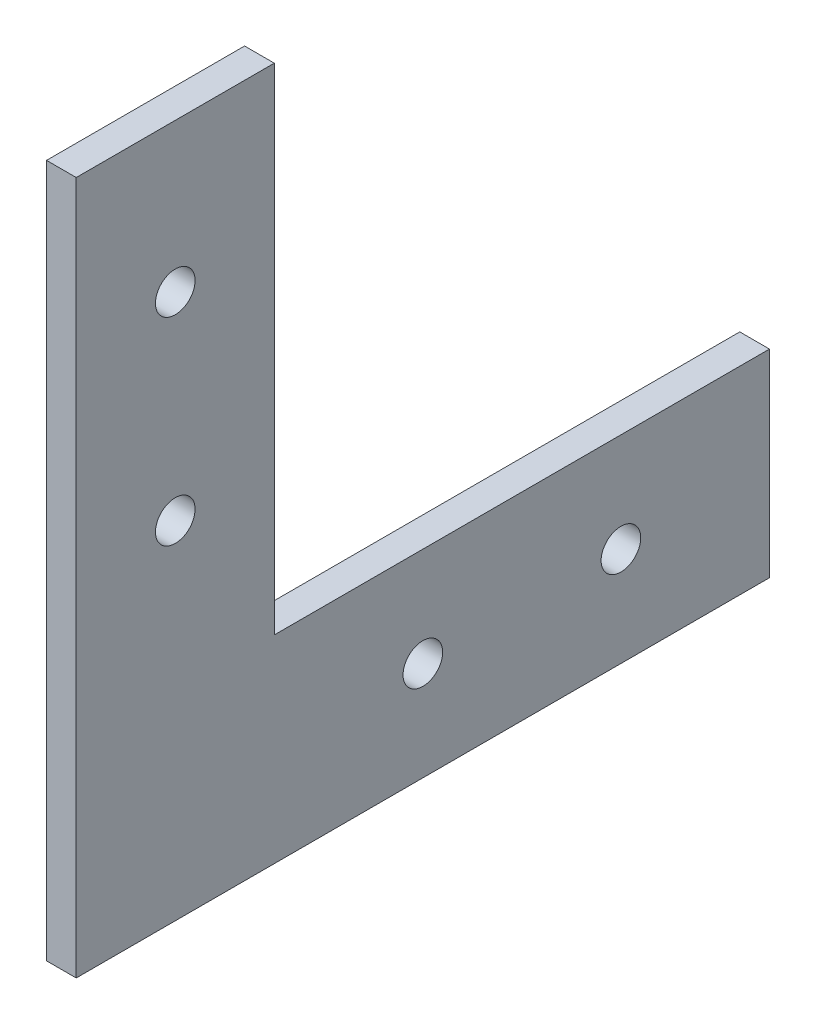
ISO-10303-21;
HEADER;
FILE_DESCRIPTION(('STEP AP214'),'2;1');
FILE_NAME('part.step','',(''),(''),'','','');
FILE_SCHEMA(('AUTOMOTIVE_DESIGN { 1 0 10303 214 1 1 1 1 }'));
ENDSEC;
DATA;
#1=APPLICATION_CONTEXT('core data for automotive mechanical design processes');
#2=APPLICATION_PROTOCOL_DEFINITION('international standard','automotive_design',2000,#1);
#3=PRODUCT_CONTEXT('',#1,'mechanical');
#4=PRODUCT('Part','Part','',(#3));
#5=PRODUCT_RELATED_PRODUCT_CATEGORY('part','',(#4));
#6=PRODUCT_DEFINITION_FORMATION('','',#4);
#7=PRODUCT_DEFINITION_CONTEXT('part definition',#1,'design');
#8=PRODUCT_DEFINITION('design','',#6,#7);
#9=PRODUCT_DEFINITION_SHAPE('','',#8);
#10=(LENGTH_UNIT() NAMED_UNIT(*) SI_UNIT(.MILLI.,.METRE.));
#11=(NAMED_UNIT(*) PLANE_ANGLE_UNIT() SI_UNIT($,.RADIAN.));
#12=(NAMED_UNIT(*) SI_UNIT($,.STERADIAN.) SOLID_ANGLE_UNIT());
#13=UNCERTAINTY_MEASURE_WITH_UNIT(LENGTH_MEASURE(1.E-05),#10,'distance_accuracy_value','');
#14=(GEOMETRIC_REPRESENTATION_CONTEXT(3) GLOBAL_UNCERTAINTY_ASSIGNED_CONTEXT((#13)) GLOBAL_UNIT_ASSIGNED_CONTEXT((#10,
#11,#12)) REPRESENTATION_CONTEXT('',''));
#15=CARTESIAN_POINT('',(0.,0.,0.));
#16=DIRECTION('',(0.,0.,1.));
#17=DIRECTION('',(1.,0.,0.));
#18=AXIS2_PLACEMENT_3D('',#15,#16,#17);
#19=CARTESIAN_POINT('',(3.,0.,0.));
#20=DIRECTION('',(0.,0.,1.));
#21=DIRECTION('',(1.,0.,0.));
#22=AXIS2_PLACEMENT_3D('',#19,#20,#21);
#23=PLANE('',#22);
#24=DIRECTION('',(0.,1.,0.));
#25=VECTOR('',#24,1.);
#26=CARTESIAN_POINT('',(0.,0.,0.));
#27=LINE('',#26,#25);
#28=CARTESIAN_POINT('',(0.,0.,0.));
#29=VERTEX_POINT('',#28);
#30=CARTESIAN_POINT('',(0.,70.,0.));
#31=VERTEX_POINT('',#30);
#32=EDGE_CURVE('E131',#29,#31,#27,.T.);
#33=ORIENTED_EDGE('',*,*,#32,.F.);
#34=DIRECTION('',(-1.,0.,0.));
#35=VECTOR('',#34,1.);
#36=CARTESIAN_POINT('',(3.,0.,0.));
#37=LINE('',#36,#35);
#38=CARTESIAN_POINT('',(3.,0.,0.));
#39=VERTEX_POINT('',#38);
#40=EDGE_CURVE('E11',#39,#29,#37,.T.);
#41=ORIENTED_EDGE('',*,*,#40,.F.);
#42=DIRECTION('',(0.,1.,0.));
#43=VECTOR('',#42,1.);
#44=CARTESIAN_POINT('',(3.,0.,0.));
#45=LINE('',#44,#43);
#46=CARTESIAN_POINT('',(3.,70.,0.));
#47=VERTEX_POINT('',#46);
#48=EDGE_CURVE('E305',#39,#47,#45,.T.);
#49=ORIENTED_EDGE('',*,*,#48,.T.);
#50=DIRECTION('',(-1.,0.,0.));
#51=VECTOR('',#50,1.);
#52=CARTESIAN_POINT('',(3.,70.,0.));
#53=LINE('',#52,#51);
#54=EDGE_CURVE('E51',#47,#31,#53,.T.);
#55=ORIENTED_EDGE('',*,*,#54,.T.);
#56=EDGE_LOOP('',(#33,#41,#49,#55));
#57=FACE_BOUND('',#56,.T.);
#58=ADVANCED_FACE('F34',(#57),#23,.T.);
#59=CARTESIAN_POINT('',(3.,0.,0.));
#60=DIRECTION('',(0.,1.,0.));
#61=DIRECTION('',(0.,0.,1.));
#62=AXIS2_PLACEMENT_3D('',#59,#60,#61);
#63=PLANE('',#62);
#64=DIRECTION('',(0.,0.,-1.));
#65=VECTOR('',#64,1.);
#66=CARTESIAN_POINT('',(0.,0.,0.));
#67=LINE('',#66,#65);
#68=CARTESIAN_POINT('',(0.,0.,-70.));
#69=VERTEX_POINT('',#68);
#70=EDGE_CURVE('E133',#29,#69,#67,.T.);
#71=ORIENTED_EDGE('',*,*,#70,.T.);
#72=DIRECTION('',(-1.,0.,0.));
#73=VECTOR('',#72,1.);
#74=CARTESIAN_POINT('',(3.,0.,-70.));
#75=LINE('',#74,#73);
#76=CARTESIAN_POINT('',(3.,0.,-70.));
#77=VERTEX_POINT('',#76);
#78=EDGE_CURVE('E43',#77,#69,#75,.T.);
#79=ORIENTED_EDGE('',*,*,#78,.F.);
#80=DIRECTION('',(0.,0.,-1.));
#81=VECTOR('',#80,1.);
#82=CARTESIAN_POINT('',(3.,0.,0.));
#83=LINE('',#82,#81);
#84=EDGE_CURVE('E114',#39,#77,#83,.T.);
#85=ORIENTED_EDGE('',*,*,#84,.F.);
#86=ORIENTED_EDGE('',*,*,#40,.T.);
#87=EDGE_LOOP('',(#71,#79,#85,#86));
#88=FACE_BOUND('',#87,.T.);
#89=ADVANCED_FACE('F160',(#88),#63,.F.);
#90=CARTESIAN_POINT('',(3.,0.,-70.));
#91=DIRECTION('',(0.,0.,1.));
#92=DIRECTION('',(1.,0.,0.));
#93=AXIS2_PLACEMENT_3D('',#90,#91,#92);
#94=PLANE('',#93);
#95=DIRECTION('',(0.,1.,0.));
#96=VECTOR('',#95,1.);
#97=CARTESIAN_POINT('',(0.,0.,-70.));
#98=LINE('',#97,#96);
#99=CARTESIAN_POINT('',(0.,20.,-70.));
#100=VERTEX_POINT('',#99);
#101=EDGE_CURVE('E136',#69,#100,#98,.T.);
#102=ORIENTED_EDGE('',*,*,#101,.T.);
#103=DIRECTION('',(-1.,0.,0.));
#104=VECTOR('',#103,1.);
#105=CARTESIAN_POINT('',(3.,20.,-70.));
#106=LINE('',#105,#104);
#107=CARTESIAN_POINT('',(3.,20.,-70.));
#108=VERTEX_POINT('',#107);
#109=EDGE_CURVE('E99',#108,#100,#106,.T.);
#110=ORIENTED_EDGE('',*,*,#109,.F.);
#111=DIRECTION('',(0.,1.,0.));
#112=VECTOR('',#111,1.);
#113=CARTESIAN_POINT('',(3.,0.,-70.));
#114=LINE('',#113,#112);
#115=EDGE_CURVE('E111',#77,#108,#114,.T.);
#116=ORIENTED_EDGE('',*,*,#115,.F.);
#117=ORIENTED_EDGE('',*,*,#78,.T.);
#118=EDGE_LOOP('',(#102,#110,#116,#117));
#119=FACE_BOUND('',#118,.T.);
#120=ADVANCED_FACE('F157',(#119),#94,.F.);
#121=CARTESIAN_POINT('',(3.,20.,0.));
#122=DIRECTION('',(0.,1.,0.));
#123=DIRECTION('',(0.,0.,1.));
#124=AXIS2_PLACEMENT_3D('',#121,#122,#123);
#125=PLANE('',#124);
#126=DIRECTION('',(0.,0.,-1.));
#127=VECTOR('',#126,1.);
#128=CARTESIAN_POINT('',(0.,20.,0.));
#129=LINE('',#128,#127);
#130=CARTESIAN_POINT('',(0.,20.,-20.));
#131=VERTEX_POINT('',#130);
#132=EDGE_CURVE('E96',#131,#100,#129,.T.);
#133=ORIENTED_EDGE('',*,*,#132,.F.);
#134=DIRECTION('',(-1.,0.,0.));
#135=VECTOR('',#134,1.);
#136=CARTESIAN_POINT('',(3.,20.,-20.));
#137=LINE('',#136,#135);
#138=CARTESIAN_POINT('',(3.,20.,-20.));
#139=VERTEX_POINT('',#138);
#140=EDGE_CURVE('E90',#139,#131,#137,.T.);
#141=ORIENTED_EDGE('',*,*,#140,.F.);
#142=DIRECTION('',(0.,0.,-1.));
#143=VECTOR('',#142,1.);
#144=CARTESIAN_POINT('',(3.,20.,0.));
#145=LINE('',#144,#143);
#146=EDGE_CURVE('E94',#139,#108,#145,.T.);
#147=ORIENTED_EDGE('',*,*,#146,.T.);
#148=ORIENTED_EDGE('',*,*,#109,.T.);
#149=EDGE_LOOP('',(#133,#141,#147,#148));
#150=FACE_BOUND('',#149,.T.);
#151=ADVANCED_FACE('F92',(#150),#125,.T.);
#152=CARTESIAN_POINT('',(3.,0.,-20.));
#153=DIRECTION('',(0.,0.,1.));
#154=DIRECTION('',(1.,0.,0.));
#155=AXIS2_PLACEMENT_3D('',#152,#153,#154);
#156=PLANE('',#155);
#157=DIRECTION('',(0.,1.,0.));
#158=VECTOR('',#157,1.);
#159=CARTESIAN_POINT('',(0.,0.,-20.));
#160=LINE('',#159,#158);
#161=CARTESIAN_POINT('',(0.,70.,-20.));
#162=VERTEX_POINT('',#161);
#163=EDGE_CURVE('E140',#131,#162,#160,.T.);
#164=ORIENTED_EDGE('',*,*,#163,.T.);
#165=DIRECTION('',(-1.,0.,0.));
#166=VECTOR('',#165,1.);
#167=CARTESIAN_POINT('',(3.,70.,-20.));
#168=LINE('',#167,#166);
#169=CARTESIAN_POINT('',(3.,70.,-20.));
#170=VERTEX_POINT('',#169);
#171=EDGE_CURVE('E71',#170,#162,#168,.T.);
#172=ORIENTED_EDGE('',*,*,#171,.F.);
#173=DIRECTION('',(0.,1.,0.));
#174=VECTOR('',#173,1.);
#175=CARTESIAN_POINT('',(3.,0.,-20.));
#176=LINE('',#175,#174);
#177=EDGE_CURVE('E101',#139,#170,#176,.T.);
#178=ORIENTED_EDGE('',*,*,#177,.F.);
#179=ORIENTED_EDGE('',*,*,#140,.T.);
#180=EDGE_LOOP('',(#164,#172,#178,#179));
#181=FACE_BOUND('',#180,.T.);
#182=ADVANCED_FACE('F102',(#181),#156,.F.);
#183=CARTESIAN_POINT('',(3.,10.,-35.));
#184=DIRECTION('',(-1.,0.,0.));
#185=DIRECTION('',(0.,0.,1.));
#186=AXIS2_PLACEMENT_3D('',#183,#184,#185);
#187=CYLINDRICAL_SURFACE('',#186,2.);
#188=CARTESIAN_POINT('',(3.,10.,-35.));
#189=DIRECTION('',(1.,0.,0.));
#190=DIRECTION('',(0.,0.,-1.));
#191=AXIS2_PLACEMENT_3D('',#188,#189,#190);
#192=CIRCLE('',#191,2.);
#193=CARTESIAN_POINT('',(3.,10.,-37.));
#194=VERTEX_POINT('',#193);
#195=EDGE_CURVE('E119',#194,#194,#192,.T.);
#196=ORIENTED_EDGE('',*,*,#195,.T.);
#197=EDGE_LOOP('',(#196));
#198=FACE_BOUND('',#197,.T.);
#199=CARTESIAN_POINT('',(0.,10.,-35.));
#200=DIRECTION('',(1.,0.,0.));
#201=DIRECTION('',(0.,0.,-1.));
#202=AXIS2_PLACEMENT_3D('',#199,#200,#201);
#203=CIRCLE('',#202,2.);
#204=CARTESIAN_POINT('',(0.,10.,-37.));
#205=VERTEX_POINT('',#204);
#206=EDGE_CURVE('E145',#205,#205,#203,.T.);
#207=ORIENTED_EDGE('',*,*,#206,.F.);
#208=EDGE_LOOP('',(#207));
#209=FACE_BOUND('',#208,.T.);
#210=ADVANCED_FACE('F181',(#198,#209),#187,.F.);
#211=CARTESIAN_POINT('',(3.,70.,0.));
#212=DIRECTION('',(0.,1.,0.));
#213=DIRECTION('',(0.,0.,1.));
#214=AXIS2_PLACEMENT_3D('',#211,#212,#213);
#215=PLANE('',#214);
#216=DIRECTION('',(0.,0.,-1.));
#217=VECTOR('',#216,1.);
#218=CARTESIAN_POINT('',(0.,70.,0.));
#219=LINE('',#218,#217);
#220=EDGE_CURVE('E142',#31,#162,#219,.T.);
#221=ORIENTED_EDGE('',*,*,#220,.F.);
#222=ORIENTED_EDGE('',*,*,#54,.F.);
#223=DIRECTION('',(0.,0.,-1.));
#224=VECTOR('',#223,1.);
#225=CARTESIAN_POINT('',(3.,70.,0.));
#226=LINE('',#225,#224);
#227=EDGE_CURVE('E105',#47,#170,#226,.T.);
#228=ORIENTED_EDGE('',*,*,#227,.T.);
#229=ORIENTED_EDGE('',*,*,#171,.T.);
#230=EDGE_LOOP('',(#221,#222,#228,#229));
#231=FACE_BOUND('',#230,.T.);
#232=ADVANCED_FACE('F173',(#231),#215,.T.);
#233=CARTESIAN_POINT('',(3.,35.,-10.));
#234=DIRECTION('',(-1.,0.,0.));
#235=DIRECTION('',(0.,0.,1.));
#236=AXIS2_PLACEMENT_3D('',#233,#234,#235);
#237=CYLINDRICAL_SURFACE('',#236,2.);
#238=CARTESIAN_POINT('',(3.,35.,-10.));
#239=DIRECTION('',(1.,0.,0.));
#240=DIRECTION('',(0.,0.,-1.));
#241=AXIS2_PLACEMENT_3D('',#238,#239,#240);
#242=CIRCLE('',#241,2.);
#243=CARTESIAN_POINT('',(3.,35.,-12.));
#244=VERTEX_POINT('',#243);
#245=EDGE_CURVE('E186',#244,#244,#242,.T.);
#246=ORIENTED_EDGE('',*,*,#245,.T.);
#247=EDGE_LOOP('',(#246));
#248=FACE_BOUND('',#247,.T.);
#249=CARTESIAN_POINT('',(0.,35.,-10.));
#250=DIRECTION('',(1.,0.,0.));
#251=DIRECTION('',(0.,0.,-1.));
#252=AXIS2_PLACEMENT_3D('',#249,#250,#251);
#253=CIRCLE('',#252,2.);
#254=CARTESIAN_POINT('',(0.,35.,-12.));
#255=VERTEX_POINT('',#254);
#256=EDGE_CURVE('E128',#255,#255,#253,.T.);
#257=ORIENTED_EDGE('',*,*,#256,.F.);
#258=EDGE_LOOP('',(#257));
#259=FACE_BOUND('',#258,.T.);
#260=ADVANCED_FACE('F171',(#248,#259),#237,.F.);
#261=CARTESIAN_POINT('',(3.,55.,-10.));
#262=DIRECTION('',(-1.,0.,0.));
#263=DIRECTION('',(0.,0.,1.));
#264=AXIS2_PLACEMENT_3D('',#261,#262,#263);
#265=CYLINDRICAL_SURFACE('',#264,2.);
#266=CARTESIAN_POINT('',(3.,55.,-10.));
#267=DIRECTION('',(1.,0.,0.));
#268=DIRECTION('',(0.,0.,-1.));
#269=AXIS2_PLACEMENT_3D('',#266,#267,#268);
#270=CIRCLE('',#269,2.);
#271=CARTESIAN_POINT('',(3.,55.,-12.));
#272=VERTEX_POINT('',#271);
#273=EDGE_CURVE('E151',#272,#272,#270,.T.);
#274=ORIENTED_EDGE('',*,*,#273,.T.);
#275=EDGE_LOOP('',(#274));
#276=FACE_BOUND('',#275,.T.);
#277=CARTESIAN_POINT('',(0.,55.,-10.));
#278=DIRECTION('',(1.,0.,0.));
#279=DIRECTION('',(0.,0.,-1.));
#280=AXIS2_PLACEMENT_3D('',#277,#278,#279);
#281=CIRCLE('',#280,2.);
#282=CARTESIAN_POINT('',(0.,55.,-12.));
#283=VERTEX_POINT('',#282);
#284=EDGE_CURVE('E125',#283,#283,#281,.T.);
#285=ORIENTED_EDGE('',*,*,#284,.F.);
#286=EDGE_LOOP('',(#285));
#287=FACE_BOUND('',#286,.T.);
#288=ADVANCED_FACE('F36',(#276,#287),#265,.F.);
#289=CARTESIAN_POINT('',(3.,10.,-55.));
#290=DIRECTION('',(-1.,0.,0.));
#291=DIRECTION('',(0.,0.,1.));
#292=AXIS2_PLACEMENT_3D('',#289,#290,#291);
#293=CYLINDRICAL_SURFACE('',#292,2.);
#294=CARTESIAN_POINT('',(3.,10.,-55.));
#295=DIRECTION('',(1.,0.,0.));
#296=DIRECTION('',(0.,0.,-1.));
#297=AXIS2_PLACEMENT_3D('',#294,#295,#296);
#298=CIRCLE('',#297,2.);
#299=CARTESIAN_POINT('',(3.,10.,-57.));
#300=VERTEX_POINT('',#299);
#301=EDGE_CURVE('E122',#300,#300,#298,.T.);
#302=ORIENTED_EDGE('',*,*,#301,.T.);
#303=EDGE_LOOP('',(#302));
#304=FACE_BOUND('',#303,.T.);
#305=CARTESIAN_POINT('',(0.,10.,-55.));
#306=DIRECTION('',(1.,0.,0.));
#307=DIRECTION('',(0.,0.,-1.));
#308=AXIS2_PLACEMENT_3D('',#305,#306,#307);
#309=CIRCLE('',#308,2.);
#310=CARTESIAN_POINT('',(0.,10.,-57.));
#311=VERTEX_POINT('',#310);
#312=EDGE_CURVE('E148',#311,#311,#309,.T.);
#313=ORIENTED_EDGE('',*,*,#312,.F.);
#314=EDGE_LOOP('',(#313));
#315=FACE_BOUND('',#314,.T.);
#316=ADVANCED_FACE('F179',(#304,#315),#293,.F.);
#317=CARTESIAN_POINT('',(3.,0.,0.));
#318=DIRECTION('',(1.,0.,0.));
#319=DIRECTION('',(0.,0.,-1.));
#320=AXIS2_PLACEMENT_3D('',#317,#318,#319);
#321=PLANE('',#320);
#322=ORIENTED_EDGE('',*,*,#273,.F.);
#323=EDGE_LOOP('',(#322));
#324=FACE_BOUND('',#323,.T.);
#325=ORIENTED_EDGE('',*,*,#245,.F.);
#326=EDGE_LOOP('',(#325));
#327=FACE_BOUND('',#326,.T.);
#328=ORIENTED_EDGE('',*,*,#48,.F.);
#329=ORIENTED_EDGE('',*,*,#84,.T.);
#330=ORIENTED_EDGE('',*,*,#115,.T.);
#331=ORIENTED_EDGE('',*,*,#146,.F.);
#332=ORIENTED_EDGE('',*,*,#177,.T.);
#333=ORIENTED_EDGE('',*,*,#227,.F.);
#334=EDGE_LOOP('',(#328,#329,#330,#331,#332,#333));
#335=FACE_BOUND('',#334,.T.);
#336=ORIENTED_EDGE('',*,*,#195,.F.);
#337=EDGE_LOOP('',(#336));
#338=FACE_BOUND('',#337,.T.);
#339=ORIENTED_EDGE('',*,*,#301,.F.);
#340=EDGE_LOOP('',(#339));
#341=FACE_BOUND('',#340,.T.);
#342=ADVANCED_FACE('F108',(#324,#327,#335,#338,#341),#321,.T.);
#343=CARTESIAN_POINT('',(0.,0.,0.));
#344=DIRECTION('',(1.,0.,0.));
#345=DIRECTION('',(0.,0.,-1.));
#346=AXIS2_PLACEMENT_3D('',#343,#344,#345);
#347=PLANE('',#346);
#348=ORIENTED_EDGE('',*,*,#284,.T.);
#349=EDGE_LOOP('',(#348));
#350=FACE_BOUND('',#349,.T.);
#351=ORIENTED_EDGE('',*,*,#256,.T.);
#352=EDGE_LOOP('',(#351));
#353=FACE_BOUND('',#352,.T.);
#354=ORIENTED_EDGE('',*,*,#32,.T.);
#355=ORIENTED_EDGE('',*,*,#220,.T.);
#356=ORIENTED_EDGE('',*,*,#163,.F.);
#357=ORIENTED_EDGE('',*,*,#132,.T.);
#358=ORIENTED_EDGE('',*,*,#101,.F.);
#359=ORIENTED_EDGE('',*,*,#70,.F.);
#360=EDGE_LOOP('',(#354,#355,#356,#357,#358,#359));
#361=FACE_BOUND('',#360,.T.);
#362=ORIENTED_EDGE('',*,*,#206,.T.);
#363=EDGE_LOOP('',(#362));
#364=FACE_BOUND('',#363,.T.);
#365=ORIENTED_EDGE('',*,*,#312,.T.);
#366=EDGE_LOOP('',(#365));
#367=FACE_BOUND('',#366,.T.);
#368=ADVANCED_FACE('F162',(#350,#353,#361,#364,#367),#347,.F.);
#369=CLOSED_SHELL('',(#58,#89,#120,#151,#182,#210,#232,#260,#288,#316,#342,#368));
#370=MANIFOLD_SOLID_BREP('B2',#369);
#371=ADVANCED_BREP_SHAPE_REPRESENTATION('',(#18,#370),#14);
#372=SHAPE_DEFINITION_REPRESENTATION(#9,#371);
ENDSEC;
END-ISO-10303-21;
